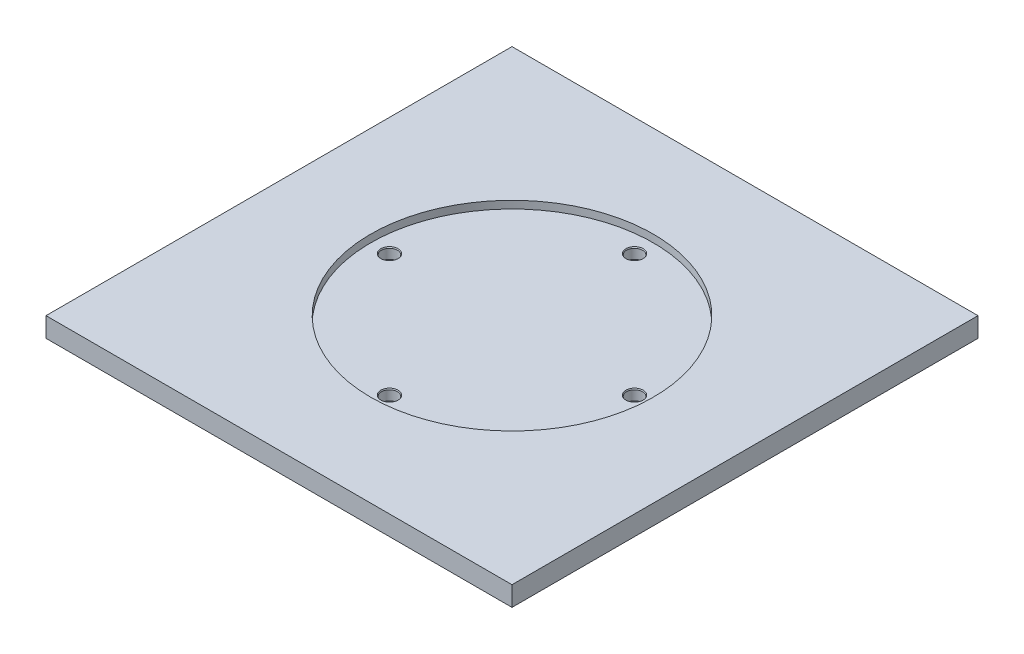
ISO-10303-21;
HEADER;
FILE_DESCRIPTION(('STEP AP214'),'2;1');
FILE_NAME('part.step','',(''),(''),'','','');
FILE_SCHEMA(('AUTOMOTIVE_DESIGN { 1 0 10303 214 1 1 1 1 }'));
ENDSEC;
DATA;
#1=APPLICATION_CONTEXT('core data for automotive mechanical design processes');
#2=APPLICATION_PROTOCOL_DEFINITION('international standard','automotive_design',2000,#1);
#3=PRODUCT_CONTEXT('',#1,'mechanical');
#4=PRODUCT('Part','Part','',(#3));
#5=PRODUCT_RELATED_PRODUCT_CATEGORY('part','',(#4));
#6=PRODUCT_DEFINITION_FORMATION('','',#4);
#7=PRODUCT_DEFINITION_CONTEXT('part definition',#1,'design');
#8=PRODUCT_DEFINITION('design','',#6,#7);
#9=PRODUCT_DEFINITION_SHAPE('','',#8);
#10=(LENGTH_UNIT() NAMED_UNIT(*) SI_UNIT(.MILLI.,.METRE.));
#11=(NAMED_UNIT(*) PLANE_ANGLE_UNIT() SI_UNIT($,.RADIAN.));
#12=(NAMED_UNIT(*) SI_UNIT($,.STERADIAN.) SOLID_ANGLE_UNIT());
#13=UNCERTAINTY_MEASURE_WITH_UNIT(LENGTH_MEASURE(1.E-05),#10,'distance_accuracy_value','');
#14=(GEOMETRIC_REPRESENTATION_CONTEXT(3) GLOBAL_UNCERTAINTY_ASSIGNED_CONTEXT((#13)) GLOBAL_UNIT_ASSIGNED_CONTEXT((#10,
#11,#12)) REPRESENTATION_CONTEXT('',''));
#15=CARTESIAN_POINT('',(0.,0.,0.));
#16=DIRECTION('',(0.,0.,1.));
#17=DIRECTION('',(1.,0.,0.));
#18=AXIS2_PLACEMENT_3D('',#15,#16,#17);
#19=CARTESIAN_POINT('',(77.,6.5,77.));
#20=DIRECTION('',(-1.,0.,0.));
#21=DIRECTION('',(0.,0.,1.));
#22=AXIS2_PLACEMENT_3D('',#19,#20,#21);
#23=PLANE('',#22);
#24=DIRECTION('',(0.,0.,-1.));
#25=VECTOR('',#24,1.);
#26=CARTESIAN_POINT('',(77.,0.,77.));
#27=LINE('',#26,#25);
#28=CARTESIAN_POINT('',(77.,0.,77.));
#29=VERTEX_POINT('',#28);
#30=CARTESIAN_POINT('',(77.,0.,-77.));
#31=VERTEX_POINT('',#30);
#32=EDGE_CURVE('E116',#29,#31,#27,.T.);
#33=ORIENTED_EDGE('',*,*,#32,.T.);
#34=DIRECTION('',(0.,-1.,0.));
#35=VECTOR('',#34,1.);
#36=CARTESIAN_POINT('',(77.,6.5,-77.));
#37=LINE('',#36,#35);
#38=CARTESIAN_POINT('',(77.,6.5,-77.));
#39=VERTEX_POINT('',#38);
#40=EDGE_CURVE('E107',#39,#31,#37,.T.);
#41=ORIENTED_EDGE('',*,*,#40,.F.);
#42=DIRECTION('',(0.,0.,-1.));
#43=VECTOR('',#42,1.);
#44=CARTESIAN_POINT('',(77.,6.5,77.));
#45=LINE('',#44,#43);
#46=CARTESIAN_POINT('',(77.,6.5,77.));
#47=VERTEX_POINT('',#46);
#48=EDGE_CURVE('E101',#47,#39,#45,.T.);
#49=ORIENTED_EDGE('',*,*,#48,.F.);
#50=DIRECTION('',(0.,-1.,0.));
#51=VECTOR('',#50,1.);
#52=CARTESIAN_POINT('',(77.,6.5,77.));
#53=LINE('',#52,#51);
#54=EDGE_CURVE('E112',#47,#29,#53,.T.);
#55=ORIENTED_EDGE('',*,*,#54,.T.);
#56=EDGE_LOOP('',(#33,#41,#49,#55));
#57=FACE_BOUND('',#56,.T.);
#58=ADVANCED_FACE('F47',(#57),#23,.F.);
#59=CARTESIAN_POINT('',(-77.,6.5,-77.));
#60=DIRECTION('',(0.,0.,1.));
#61=DIRECTION('',(1.,0.,0.));
#62=AXIS2_PLACEMENT_3D('',#59,#60,#61);
#63=PLANE('',#62);
#64=DIRECTION('',(-1.,0.,0.));
#65=VECTOR('',#64,1.);
#66=CARTESIAN_POINT('',(-77.,0.,-77.));
#67=LINE('',#66,#65);
#68=CARTESIAN_POINT('',(-77.,0.,-77.));
#69=VERTEX_POINT('',#68);
#70=EDGE_CURVE('E106',#31,#69,#67,.T.);
#71=ORIENTED_EDGE('',*,*,#70,.T.);
#72=DIRECTION('',(0.,-1.,0.));
#73=VECTOR('',#72,1.);
#74=CARTESIAN_POINT('',(-77.,6.5,-77.));
#75=LINE('',#74,#73);
#76=CARTESIAN_POINT('',(-77.,6.5,-77.));
#77=VERTEX_POINT('',#76);
#78=EDGE_CURVE('E104',#77,#69,#75,.T.);
#79=ORIENTED_EDGE('',*,*,#78,.F.);
#80=DIRECTION('',(-1.,0.,0.));
#81=VECTOR('',#80,1.);
#82=CARTESIAN_POINT('',(-77.,6.5,-77.));
#83=LINE('',#82,#81);
#84=EDGE_CURVE('E96',#39,#77,#83,.T.);
#85=ORIENTED_EDGE('',*,*,#84,.F.);
#86=ORIENTED_EDGE('',*,*,#40,.T.);
#87=EDGE_LOOP('',(#71,#79,#85,#86));
#88=FACE_BOUND('',#87,.T.);
#89=ADVANCED_FACE('F105',(#88),#63,.F.);
#90=CARTESIAN_POINT('',(-77.,6.5,77.));
#91=DIRECTION('',(1.,0.,0.));
#92=DIRECTION('',(0.,0.,-1.));
#93=AXIS2_PLACEMENT_3D('',#90,#91,#92);
#94=PLANE('',#93);
#95=DIRECTION('',(0.,0.,1.));
#96=VECTOR('',#95,1.);
#97=CARTESIAN_POINT('',(-77.,0.,77.));
#98=LINE('',#97,#96);
#99=CARTESIAN_POINT('',(-77.,0.,77.));
#100=VERTEX_POINT('',#99);
#101=EDGE_CURVE('E82',#69,#100,#98,.T.);
#102=ORIENTED_EDGE('',*,*,#101,.T.);
#103=DIRECTION('',(0.,-1.,0.));
#104=VECTOR('',#103,1.);
#105=CARTESIAN_POINT('',(-77.,6.5,77.));
#106=LINE('',#105,#104);
#107=CARTESIAN_POINT('',(-77.,6.5,77.));
#108=VERTEX_POINT('',#107);
#109=EDGE_CURVE('E108',#108,#100,#106,.T.);
#110=ORIENTED_EDGE('',*,*,#109,.F.);
#111=DIRECTION('',(0.,0.,1.));
#112=VECTOR('',#111,1.);
#113=CARTESIAN_POINT('',(-77.,6.5,77.));
#114=LINE('',#113,#112);
#115=EDGE_CURVE('E99',#77,#108,#114,.T.);
#116=ORIENTED_EDGE('',*,*,#115,.F.);
#117=ORIENTED_EDGE('',*,*,#78,.T.);
#118=EDGE_LOOP('',(#102,#110,#116,#117));
#119=FACE_BOUND('',#118,.T.);
#120=ADVANCED_FACE('F110',(#119),#94,.F.);
#121=CARTESIAN_POINT('',(-77.,6.5,77.));
#122=DIRECTION('',(0.,0.,-1.));
#123=DIRECTION('',(-1.,0.,0.));
#124=AXIS2_PLACEMENT_3D('',#121,#122,#123);
#125=PLANE('',#124);
#126=DIRECTION('',(1.,0.,0.));
#127=VECTOR('',#126,1.);
#128=CARTESIAN_POINT('',(-77.,0.,77.));
#129=LINE('',#128,#127);
#130=EDGE_CURVE('E88',#100,#29,#129,.T.);
#131=ORIENTED_EDGE('',*,*,#130,.T.);
#132=ORIENTED_EDGE('',*,*,#54,.F.);
#133=DIRECTION('',(1.,0.,0.));
#134=VECTOR('',#133,1.);
#135=CARTESIAN_POINT('',(-77.,6.5,77.));
#136=LINE('',#135,#134);
#137=EDGE_CURVE('E65',#108,#47,#136,.T.);
#138=ORIENTED_EDGE('',*,*,#137,.F.);
#139=ORIENTED_EDGE('',*,*,#109,.T.);
#140=EDGE_LOOP('',(#131,#132,#138,#139));
#141=FACE_BOUND('',#140,.T.);
#142=ADVANCED_FACE('F226',(#141),#125,.F.);
#143=CARTESIAN_POINT('',(0.,6.5,0.));
#144=DIRECTION('',(0.,-1.,0.));
#145=DIRECTION('',(0.,0.,-1.));
#146=AXIS2_PLACEMENT_3D('',#143,#144,#145);
#147=PLANE('',#146);
#148=CARTESIAN_POINT('',(0.,6.5,0.));
#149=DIRECTION('',(0.,1.,0.));
#150=DIRECTION('',(0.,0.,1.));
#151=AXIS2_PLACEMENT_3D('',#148,#149,#150);
#152=CIRCLE('',#151,46.7);
#153=CARTESIAN_POINT('',(0.,6.5,46.7));
#154=VERTEX_POINT('',#153);
#155=EDGE_CURVE('E209',#154,#154,#152,.T.);
#156=ORIENTED_EDGE('',*,*,#155,.F.);
#157=EDGE_LOOP('',(#156));
#158=FACE_BOUND('',#157,.T.);
#159=ORIENTED_EDGE('',*,*,#48,.T.);
#160=ORIENTED_EDGE('',*,*,#84,.T.);
#161=ORIENTED_EDGE('',*,*,#115,.T.);
#162=ORIENTED_EDGE('',*,*,#137,.T.);
#163=EDGE_LOOP('',(#159,#160,#161,#162));
#164=FACE_BOUND('',#163,.T.);
#165=ADVANCED_FACE('F97',(#158,#164),#147,.F.);
#166=CARTESIAN_POINT('',(0.,0.,0.));
#167=DIRECTION('',(0.,-1.,0.));
#168=DIRECTION('',(0.,0.,-1.));
#169=AXIS2_PLACEMENT_3D('',#166,#167,#168);
#170=PLANE('',#169);
#171=ORIENTED_EDGE('',*,*,#32,.F.);
#172=ORIENTED_EDGE('',*,*,#130,.F.);
#173=ORIENTED_EDGE('',*,*,#101,.F.);
#174=ORIENTED_EDGE('',*,*,#70,.F.);
#175=EDGE_LOOP('',(#171,#172,#173,#174));
#176=FACE_BOUND('',#175,.T.);
#177=ADVANCED_FACE('F225',(#176),#170,.T.);
#178=CARTESIAN_POINT('',(0.,4.,0.));
#179=DIRECTION('',(0.,1.,0.));
#180=DIRECTION('',(0.,0.,1.));
#181=AXIS2_PLACEMENT_3D('',#178,#179,#180);
#182=CYLINDRICAL_SURFACE('',#181,46.7);
#183=CARTESIAN_POINT('',(0.,4.,0.));
#184=DIRECTION('',(0.,1.,0.));
#185=DIRECTION('',(0.,0.,1.));
#186=AXIS2_PLACEMENT_3D('',#183,#184,#185);
#187=CIRCLE('',#186,46.7);
#188=CARTESIAN_POINT('',(0.,4.,46.7));
#189=VERTEX_POINT('',#188);
#190=EDGE_CURVE('E119',#189,#189,#187,.T.);
#191=ORIENTED_EDGE('',*,*,#190,.F.);
#192=EDGE_LOOP('',(#191));
#193=FACE_BOUND('',#192,.T.);
#194=ORIENTED_EDGE('',*,*,#155,.T.);
#195=EDGE_LOOP('',(#194));
#196=FACE_BOUND('',#195,.T.);
#197=ADVANCED_FACE('F222',(#193,#196),#182,.F.);
#198=CARTESIAN_POINT('',(0.,4.,0.));
#199=DIRECTION('',(0.,1.,0.));
#200=DIRECTION('',(0.,0.,1.));
#201=AXIS2_PLACEMENT_3D('',#198,#199,#200);
#202=PLANE('',#201);
#203=CARTESIAN_POINT('',(-40.5,4.,0.));
#204=DIRECTION('',(0.,1.,0.));
#205=DIRECTION('',(0.,0.,1.));
#206=AXIS2_PLACEMENT_3D('',#203,#204,#205);
#207=CIRCLE('',#206,2.85000000000005);
#208=CARTESIAN_POINT('',(-40.5,4.,2.85000000000005));
#209=VERTEX_POINT('',#208);
#210=EDGE_CURVE('E138',#209,#209,#207,.F.);
#211=ORIENTED_EDGE('',*,*,#210,.T.);
#212=EDGE_LOOP('',(#211));
#213=FACE_BOUND('',#212,.T.);
#214=CARTESIAN_POINT('',(0.,4.,40.5));
#215=DIRECTION('',(0.,1.,0.));
#216=DIRECTION('',(0.,0.,1.));
#217=AXIS2_PLACEMENT_3D('',#214,#215,#216);
#218=CIRCLE('',#217,2.84999999999999);
#219=CARTESIAN_POINT('',(0.,4.,43.35));
#220=VERTEX_POINT('',#219);
#221=EDGE_CURVE('E135',#220,#220,#218,.F.);
#222=ORIENTED_EDGE('',*,*,#221,.T.);
#223=EDGE_LOOP('',(#222));
#224=FACE_BOUND('',#223,.T.);
#225=CARTESIAN_POINT('',(0.,4.,-40.5));
#226=DIRECTION('',(0.,1.,0.));
#227=DIRECTION('',(0.,0.,1.));
#228=AXIS2_PLACEMENT_3D('',#225,#226,#227);
#229=CIRCLE('',#228,2.84999999999999);
#230=CARTESIAN_POINT('',(0.,4.,-37.65));
#231=VERTEX_POINT('',#230);
#232=EDGE_CURVE('E132',#231,#231,#229,.F.);
#233=ORIENTED_EDGE('',*,*,#232,.T.);
#234=EDGE_LOOP('',(#233));
#235=FACE_BOUND('',#234,.T.);
#236=CARTESIAN_POINT('',(40.5,4.,0.));
#237=DIRECTION('',(0.,1.,0.));
#238=DIRECTION('',(0.,0.,1.));
#239=AXIS2_PLACEMENT_3D('',#236,#237,#238);
#240=CIRCLE('',#239,2.85000000000005);
#241=CARTESIAN_POINT('',(40.5,4.,2.85000000000005));
#242=VERTEX_POINT('',#241);
#243=EDGE_CURVE('E129',#242,#242,#240,.F.);
#244=ORIENTED_EDGE('',*,*,#243,.T.);
#245=EDGE_LOOP('',(#244));
#246=FACE_BOUND('',#245,.T.);
#247=ORIENTED_EDGE('',*,*,#190,.T.);
#248=EDGE_LOOP('',(#247));
#249=FACE_BOUND('',#248,.T.);
#250=ADVANCED_FACE('F265',(#213,#224,#235,#246,#249),#202,.T.);
#251=CARTESIAN_POINT('',(40.5,0.5,0.));
#252=DIRECTION('',(0.,1.,0.));
#253=DIRECTION('',(0.,0.,1.));
#254=AXIS2_PLACEMENT_3D('',#251,#252,#253);
#255=CYLINDRICAL_SURFACE('',#254,2.65);
#256=CARTESIAN_POINT('',(40.5,3.65358983848616,0.));
#257=DIRECTION('',(0.,1.,0.));
#258=DIRECTION('',(0.,0.,1.));
#259=AXIS2_PLACEMENT_3D('',#256,#257,#258);
#260=CIRCLE('',#259,2.65);
#261=CARTESIAN_POINT('',(40.5,3.65358983848616,2.65));
#262=VERTEX_POINT('',#261);
#263=EDGE_CURVE('E11',#262,#262,#260,.T.);
#264=ORIENTED_EDGE('',*,*,#263,.T.);
#265=EDGE_LOOP('',(#264));
#266=FACE_BOUND('',#265,.T.);
#267=CARTESIAN_POINT('',(40.5,0.5,0.));
#268=DIRECTION('',(0.,1.,0.));
#269=DIRECTION('',(0.,0.,1.));
#270=AXIS2_PLACEMENT_3D('',#267,#268,#269);
#271=CIRCLE('',#270,2.65);
#272=CARTESIAN_POINT('',(40.5,0.5,2.65));
#273=VERTEX_POINT('',#272);
#274=EDGE_CURVE('E212',#273,#273,#271,.T.);
#275=ORIENTED_EDGE('',*,*,#274,.F.);
#276=EDGE_LOOP('',(#275));
#277=FACE_BOUND('',#276,.T.);
#278=ADVANCED_FACE('F275',(#266,#277),#255,.F.);
#279=CARTESIAN_POINT('',(40.5,0.5,0.));
#280=DIRECTION('',(0.,1.,0.));
#281=DIRECTION('',(0.,0.,1.));
#282=AXIS2_PLACEMENT_3D('',#279,#280,#281);
#283=PLANE('',#282);
#284=ORIENTED_EDGE('',*,*,#274,.T.);
#285=EDGE_LOOP('',(#284));
#286=FACE_BOUND('',#285,.T.);
#287=ADVANCED_FACE('F284',(#286),#283,.T.);
#288=CARTESIAN_POINT('',(0.,0.5,40.5));
#289=DIRECTION('',(0.,1.,0.));
#290=DIRECTION('',(0.,0.,1.));
#291=AXIS2_PLACEMENT_3D('',#288,#289,#290);
#292=CYLINDRICAL_SURFACE('',#291,2.65);
#293=CARTESIAN_POINT('',(0.,3.65358983848624,40.5));
#294=DIRECTION('',(0.,1.,0.));
#295=DIRECTION('',(0.,0.,1.));
#296=AXIS2_PLACEMENT_3D('',#293,#294,#295);
#297=CIRCLE('',#296,2.65);
#298=CARTESIAN_POINT('',(0.,3.65358983848624,43.15));
#299=VERTEX_POINT('',#298);
#300=EDGE_CURVE('E141',#299,#299,#297,.T.);
#301=ORIENTED_EDGE('',*,*,#300,.T.);
#302=EDGE_LOOP('',(#301));
#303=FACE_BOUND('',#302,.T.);
#304=CARTESIAN_POINT('',(0.,0.5,40.5));
#305=DIRECTION('',(0.,1.,0.));
#306=DIRECTION('',(0.,0.,1.));
#307=AXIS2_PLACEMENT_3D('',#304,#305,#306);
#308=CIRCLE('',#307,2.65);
#309=CARTESIAN_POINT('',(0.,0.5,43.15));
#310=VERTEX_POINT('',#309);
#311=EDGE_CURVE('E206',#310,#310,#308,.T.);
#312=ORIENTED_EDGE('',*,*,#311,.F.);
#313=EDGE_LOOP('',(#312));
#314=FACE_BOUND('',#313,.T.);
#315=ADVANCED_FACE('F294',(#303,#314),#292,.F.);
#316=CARTESIAN_POINT('',(0.,0.5,40.5));
#317=DIRECTION('',(0.,1.,0.));
#318=DIRECTION('',(0.,0.,1.));
#319=AXIS2_PLACEMENT_3D('',#316,#317,#318);
#320=PLANE('',#319);
#321=ORIENTED_EDGE('',*,*,#311,.T.);
#322=EDGE_LOOP('',(#321));
#323=FACE_BOUND('',#322,.T.);
#324=ADVANCED_FACE('F199',(#323),#320,.T.);
#325=CARTESIAN_POINT('',(-40.5,0.5,0.));
#326=DIRECTION('',(0.,1.,0.));
#327=DIRECTION('',(0.,0.,1.));
#328=AXIS2_PLACEMENT_3D('',#325,#326,#327);
#329=CYLINDRICAL_SURFACE('',#328,2.65);
#330=CARTESIAN_POINT('',(-40.5,3.65358983848616,0.));
#331=DIRECTION('',(0.,1.,0.));
#332=DIRECTION('',(0.,0.,1.));
#333=AXIS2_PLACEMENT_3D('',#330,#331,#332);
#334=CIRCLE('',#333,2.65);
#335=CARTESIAN_POINT('',(-40.5,3.65358983848616,2.65));
#336=VERTEX_POINT('',#335);
#337=EDGE_CURVE('E126',#336,#336,#334,.T.);
#338=ORIENTED_EDGE('',*,*,#337,.T.);
#339=EDGE_LOOP('',(#338));
#340=FACE_BOUND('',#339,.T.);
#341=CARTESIAN_POINT('',(-40.5,0.5,0.));
#342=DIRECTION('',(0.,1.,0.));
#343=DIRECTION('',(0.,0.,1.));
#344=AXIS2_PLACEMENT_3D('',#341,#342,#343);
#345=CIRCLE('',#344,2.65);
#346=CARTESIAN_POINT('',(-40.5,0.5,2.65));
#347=VERTEX_POINT('',#346);
#348=EDGE_CURVE('E203',#347,#347,#345,.T.);
#349=ORIENTED_EDGE('',*,*,#348,.F.);
#350=EDGE_LOOP('',(#349));
#351=FACE_BOUND('',#350,.T.);
#352=ADVANCED_FACE('F195',(#340,#351),#329,.F.);
#353=CARTESIAN_POINT('',(-40.5,0.5,0.));
#354=DIRECTION('',(0.,1.,0.));
#355=DIRECTION('',(0.,0.,1.));
#356=AXIS2_PLACEMENT_3D('',#353,#354,#355);
#357=PLANE('',#356);
#358=ORIENTED_EDGE('',*,*,#348,.T.);
#359=EDGE_LOOP('',(#358));
#360=FACE_BOUND('',#359,.T.);
#361=ADVANCED_FACE('F198',(#360),#357,.T.);
#362=CARTESIAN_POINT('',(0.,0.5,-40.5));
#363=DIRECTION('',(0.,1.,0.));
#364=DIRECTION('',(0.,0.,1.));
#365=AXIS2_PLACEMENT_3D('',#362,#363,#364);
#366=CYLINDRICAL_SURFACE('',#365,2.65);
#367=CARTESIAN_POINT('',(0.,3.65358983848624,-40.5));
#368=DIRECTION('',(0.,1.,0.));
#369=DIRECTION('',(0.,0.,1.));
#370=AXIS2_PLACEMENT_3D('',#367,#368,#369);
#371=CIRCLE('',#370,2.65);
#372=CARTESIAN_POINT('',(0.,3.65358983848624,-37.85));
#373=VERTEX_POINT('',#372);
#374=EDGE_CURVE('E57',#373,#373,#371,.T.);
#375=ORIENTED_EDGE('',*,*,#374,.T.);
#376=EDGE_LOOP('',(#375));
#377=FACE_BOUND('',#376,.T.);
#378=CARTESIAN_POINT('',(0.,0.5,-40.5));
#379=DIRECTION('',(0.,1.,0.));
#380=DIRECTION('',(0.,0.,1.));
#381=AXIS2_PLACEMENT_3D('',#378,#379,#380);
#382=CIRCLE('',#381,2.65);
#383=CARTESIAN_POINT('',(0.,0.5,-37.85));
#384=VERTEX_POINT('',#383);
#385=EDGE_CURVE('E205',#384,#384,#382,.T.);
#386=ORIENTED_EDGE('',*,*,#385,.F.);
#387=EDGE_LOOP('',(#386));
#388=FACE_BOUND('',#387,.T.);
#389=ADVANCED_FACE('F146',(#377,#388),#366,.F.);
#390=CARTESIAN_POINT('',(0.,0.5,-40.5));
#391=DIRECTION('',(0.,1.,0.));
#392=DIRECTION('',(0.,0.,1.));
#393=AXIS2_PLACEMENT_3D('',#390,#391,#392);
#394=PLANE('',#393);
#395=ORIENTED_EDGE('',*,*,#385,.T.);
#396=EDGE_LOOP('',(#395));
#397=FACE_BOUND('',#396,.T.);
#398=ADVANCED_FACE('F177',(#397),#394,.T.);
#399=CARTESIAN_POINT('',(-40.5,3.65358983848616,0.));
#400=DIRECTION('',(0.,1.,0.));
#401=DIRECTION('',(0.,0.,1.));
#402=AXIS2_PLACEMENT_3D('',#399,#400,#401);
#403=CONICAL_SURFACE('',#402,2.65,0.523598775598316);
#404=ORIENTED_EDGE('',*,*,#210,.F.);
#405=EDGE_LOOP('',(#404));
#406=FACE_BOUND('',#405,.T.);
#407=ORIENTED_EDGE('',*,*,#337,.F.);
#408=EDGE_LOOP('',(#407));
#409=FACE_BOUND('',#408,.T.);
#410=ADVANCED_FACE('F158',(#406,#409),#403,.F.);
#411=CARTESIAN_POINT('',(0.,3.65358983848624,40.5));
#412=DIRECTION('',(0.,1.,0.));
#413=DIRECTION('',(0.,0.,1.));
#414=AXIS2_PLACEMENT_3D('',#411,#412,#413);
#415=CONICAL_SURFACE('',#414,2.65,0.523598775598299);
#416=ORIENTED_EDGE('',*,*,#221,.F.);
#417=EDGE_LOOP('',(#416));
#418=FACE_BOUND('',#417,.T.);
#419=ORIENTED_EDGE('',*,*,#300,.F.);
#420=EDGE_LOOP('',(#419));
#421=FACE_BOUND('',#420,.T.);
#422=ADVANCED_FACE('F151',(#418,#421),#415,.F.);
#423=CARTESIAN_POINT('',(0.,3.65358983848624,-40.5));
#424=DIRECTION('',(0.,1.,0.));
#425=DIRECTION('',(0.,0.,1.));
#426=AXIS2_PLACEMENT_3D('',#423,#424,#425);
#427=CONICAL_SURFACE('',#426,2.65,0.523598775598299);
#428=ORIENTED_EDGE('',*,*,#232,.F.);
#429=EDGE_LOOP('',(#428));
#430=FACE_BOUND('',#429,.T.);
#431=ORIENTED_EDGE('',*,*,#374,.F.);
#432=EDGE_LOOP('',(#431));
#433=FACE_BOUND('',#432,.T.);
#434=ADVANCED_FACE('F149',(#430,#433),#427,.F.);
#435=CARTESIAN_POINT('',(40.5,3.65358983848616,0.));
#436=DIRECTION('',(0.,1.,0.));
#437=DIRECTION('',(0.,0.,1.));
#438=AXIS2_PLACEMENT_3D('',#435,#436,#437);
#439=CONICAL_SURFACE('',#438,2.65,0.523598775598316);
#440=ORIENTED_EDGE('',*,*,#243,.F.);
#441=EDGE_LOOP('',(#440));
#442=FACE_BOUND('',#441,.T.);
#443=ORIENTED_EDGE('',*,*,#263,.F.);
#444=EDGE_LOOP('',(#443));
#445=FACE_BOUND('',#444,.T.);
#446=ADVANCED_FACE('F50',(#442,#445),#439,.F.);
#447=CLOSED_SHELL('',(#58,#89,#120,#142,#165,#177,#197,#250,#278,#287,#315,#324,#352,#361,#389,
#398,#410,#422,#434,#446));
#448=MANIFOLD_SOLID_BREP('B2',#447);
#449=ADVANCED_BREP_SHAPE_REPRESENTATION('',(#18,#448),#14);
#450=SHAPE_DEFINITION_REPRESENTATION(#9,#449);
ENDSEC;
END-ISO-10303-21;
